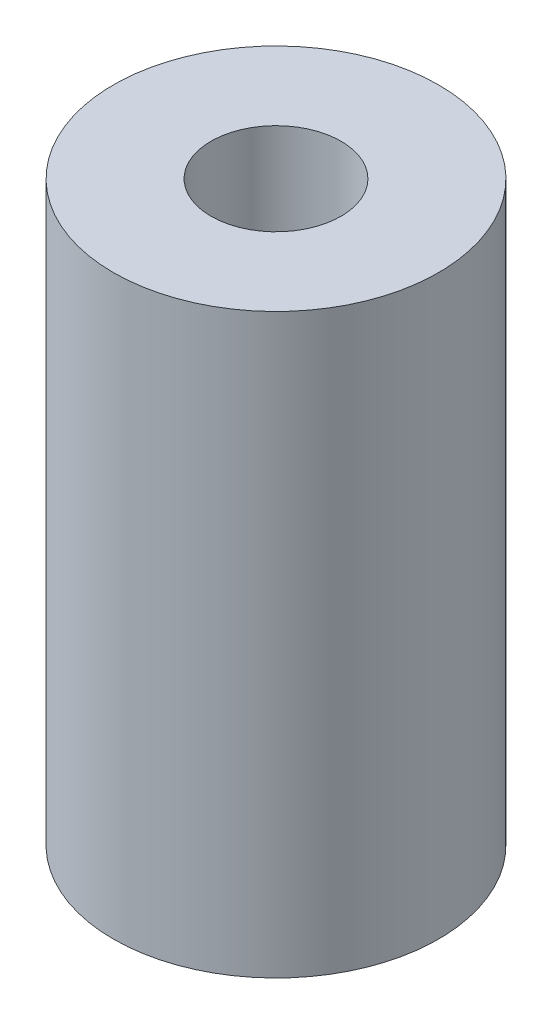
ISO-10303-21;
HEADER;
FILE_DESCRIPTION(('STEP AP214'),'2;1');
FILE_NAME('part.step','',(''),(''),'','','');
FILE_SCHEMA(('AUTOMOTIVE_DESIGN { 1 0 10303 214 1 1 1 1 }'));
ENDSEC;
DATA;
#1=APPLICATION_CONTEXT('core data for automotive mechanical design processes');
#2=APPLICATION_PROTOCOL_DEFINITION('international standard','automotive_design',2000,#1);
#3=PRODUCT_CONTEXT('',#1,'mechanical');
#4=PRODUCT('Part','Part','',(#3));
#5=PRODUCT_RELATED_PRODUCT_CATEGORY('part','',(#4));
#6=PRODUCT_DEFINITION_FORMATION('','',#4);
#7=PRODUCT_DEFINITION_CONTEXT('part definition',#1,'design');
#8=PRODUCT_DEFINITION('design','',#6,#7);
#9=PRODUCT_DEFINITION_SHAPE('','',#8);
#10=(LENGTH_UNIT() NAMED_UNIT(*) SI_UNIT(.MILLI.,.METRE.));
#11=(NAMED_UNIT(*) PLANE_ANGLE_UNIT() SI_UNIT($,.RADIAN.));
#12=(NAMED_UNIT(*) SI_UNIT($,.STERADIAN.) SOLID_ANGLE_UNIT());
#13=UNCERTAINTY_MEASURE_WITH_UNIT(LENGTH_MEASURE(1.E-05),#10,'distance_accuracy_value','');
#14=(GEOMETRIC_REPRESENTATION_CONTEXT(3) GLOBAL_UNCERTAINTY_ASSIGNED_CONTEXT((#13)) GLOBAL_UNIT_ASSIGNED_CONTEXT((#10,
#11,#12)) REPRESENTATION_CONTEXT('',''));
#15=CARTESIAN_POINT('',(0.,0.,0.));
#16=DIRECTION('',(0.,0.,1.));
#17=DIRECTION('',(1.,0.,0.));
#18=AXIS2_PLACEMENT_3D('',#15,#16,#17);
#19=CARTESIAN_POINT('',(0.,14.2,0.));
#20=DIRECTION('',(0.,1.,0.));
#21=DIRECTION('',(0.,0.,1.));
#22=AXIS2_PLACEMENT_3D('',#19,#20,#21);
#23=PLANE('',#22);
#24=CARTESIAN_POINT('',(0.,14.2,0.));
#25=DIRECTION('',(0.,1.,0.));
#26=DIRECTION('',(0.,0.,1.));
#27=AXIS2_PLACEMENT_3D('',#24,#25,#26);
#28=CIRCLE('',#27,4.);
#29=CARTESIAN_POINT('',(0.,14.2,4.));
#30=VERTEX_POINT('',#29);
#31=EDGE_CURVE('E10',#30,#30,#28,.T.);
#32=ORIENTED_EDGE('',*,*,#31,.T.);
#33=EDGE_LOOP('',(#32));
#34=FACE_BOUND('',#33,.T.);
#35=CARTESIAN_POINT('',(0.,14.2,0.));
#36=DIRECTION('',(0.,1.,0.));
#37=DIRECTION('',(0.,0.,1.));
#38=AXIS2_PLACEMENT_3D('',#35,#36,#37);
#39=CIRCLE('',#38,1.6);
#40=CARTESIAN_POINT('',(0.,14.2,1.6));
#41=VERTEX_POINT('',#40);
#42=EDGE_CURVE('E50',#41,#41,#39,.T.);
#43=ORIENTED_EDGE('',*,*,#42,.F.);
#44=EDGE_LOOP('',(#43));
#45=FACE_BOUND('',#44,.T.);
#46=ADVANCED_FACE('F37',(#34,#45),#23,.T.);
#47=CARTESIAN_POINT('',(0.,0.,0.));
#48=DIRECTION('',(0.,1.,0.));
#49=DIRECTION('',(0.,0.,1.));
#50=AXIS2_PLACEMENT_3D('',#47,#48,#49);
#51=PLANE('',#50);
#52=CARTESIAN_POINT('',(0.,0.,0.));
#53=DIRECTION('',(0.,1.,0.));
#54=DIRECTION('',(0.,0.,1.));
#55=AXIS2_PLACEMENT_3D('',#52,#53,#54);
#56=CIRCLE('',#55,4.);
#57=CARTESIAN_POINT('',(0.,0.,4.));
#58=VERTEX_POINT('',#57);
#59=EDGE_CURVE('E41',#58,#58,#56,.T.);
#60=ORIENTED_EDGE('',*,*,#59,.F.);
#61=EDGE_LOOP('',(#60));
#62=FACE_BOUND('',#61,.T.);
#63=CARTESIAN_POINT('',(0.,0.,0.));
#64=DIRECTION('',(0.,1.,0.));
#65=DIRECTION('',(0.,0.,1.));
#66=AXIS2_PLACEMENT_3D('',#63,#64,#65);
#67=CIRCLE('',#66,1.6);
#68=CARTESIAN_POINT('',(0.,0.,1.6));
#69=VERTEX_POINT('',#68);
#70=EDGE_CURVE('E52',#69,#69,#67,.T.);
#71=ORIENTED_EDGE('',*,*,#70,.T.);
#72=EDGE_LOOP('',(#71));
#73=FACE_BOUND('',#72,.T.);
#74=ADVANCED_FACE('F64',(#62,#73),#51,.F.);
#75=CARTESIAN_POINT('',(0.,14.2,0.));
#76=DIRECTION('',(0.,-1.,0.));
#77=DIRECTION('',(0.,0.,-1.));
#78=AXIS2_PLACEMENT_3D('',#75,#76,#77);
#79=CYLINDRICAL_SURFACE('',#78,4.);
#80=ORIENTED_EDGE('',*,*,#31,.F.);
#81=EDGE_LOOP('',(#80));
#82=FACE_BOUND('',#81,.T.);
#83=ORIENTED_EDGE('',*,*,#59,.T.);
#84=EDGE_LOOP('',(#83));
#85=FACE_BOUND('',#84,.T.);
#86=ADVANCED_FACE('F39',(#82,#85),#79,.T.);
#87=CARTESIAN_POINT('',(0.,14.2,0.));
#88=DIRECTION('',(0.,-1.,0.));
#89=DIRECTION('',(0.,0.,-1.));
#90=AXIS2_PLACEMENT_3D('',#87,#88,#89);
#91=CYLINDRICAL_SURFACE('',#90,1.6);
#92=ORIENTED_EDGE('',*,*,#42,.T.);
#93=EDGE_LOOP('',(#92));
#94=FACE_BOUND('',#93,.T.);
#95=ORIENTED_EDGE('',*,*,#70,.F.);
#96=EDGE_LOOP('',(#95));
#97=FACE_BOUND('',#96,.T.);
#98=ADVANCED_FACE('F60',(#94,#97),#91,.F.);
#99=CLOSED_SHELL('',(#46,#74,#86,#98));
#100=MANIFOLD_SOLID_BREP('B2',#99);
#101=ADVANCED_BREP_SHAPE_REPRESENTATION('',(#18,#100),#14);
#102=SHAPE_DEFINITION_REPRESENTATION(#9,#101);
ENDSEC;
END-ISO-10303-21;
